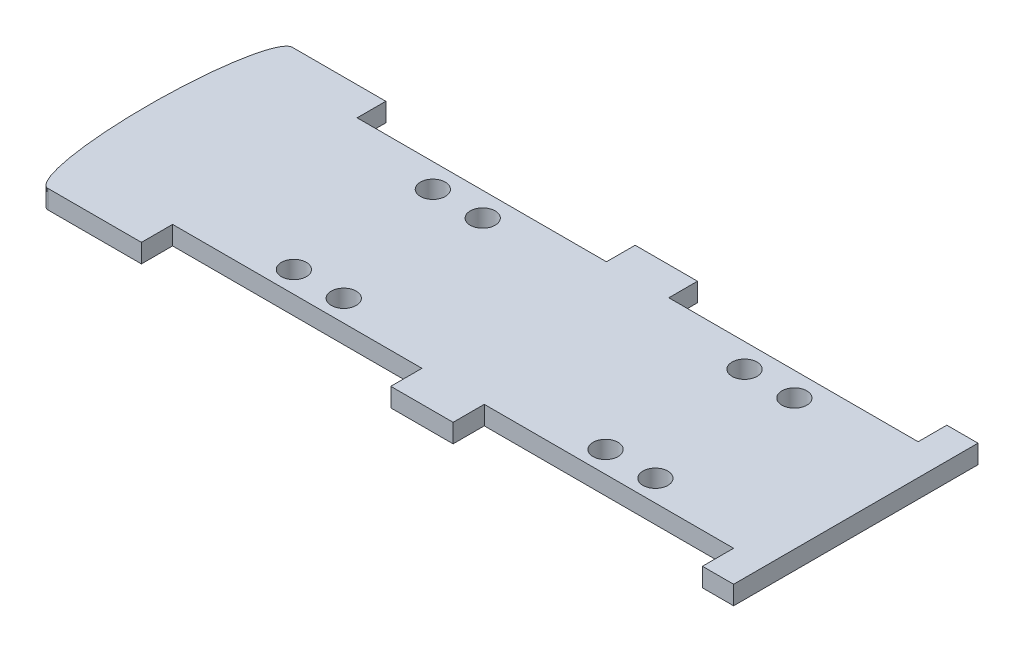
ISO-10303-21;
HEADER;
FILE_DESCRIPTION(('STEP AP214'),'2;1');
FILE_NAME('part.step','',(''),(''),'','','');
FILE_SCHEMA(('AUTOMOTIVE_DESIGN { 1 0 10303 214 1 1 1 1 }'));
ENDSEC;
DATA;
#1=APPLICATION_CONTEXT('core data for automotive mechanical design processes');
#2=APPLICATION_PROTOCOL_DEFINITION('international standard','automotive_design',2000,#1);
#3=PRODUCT_CONTEXT('',#1,'mechanical');
#4=PRODUCT('Part','Part','',(#3));
#5=PRODUCT_RELATED_PRODUCT_CATEGORY('part','',(#4));
#6=PRODUCT_DEFINITION_FORMATION('','',#4);
#7=PRODUCT_DEFINITION_CONTEXT('part definition',#1,'design');
#8=PRODUCT_DEFINITION('design','',#6,#7);
#9=PRODUCT_DEFINITION_SHAPE('','',#8);
#10=(LENGTH_UNIT() NAMED_UNIT(*) SI_UNIT(.MILLI.,.METRE.));
#11=(NAMED_UNIT(*) PLANE_ANGLE_UNIT() SI_UNIT($,.RADIAN.));
#12=(NAMED_UNIT(*) SI_UNIT($,.STERADIAN.) SOLID_ANGLE_UNIT());
#13=UNCERTAINTY_MEASURE_WITH_UNIT(LENGTH_MEASURE(1.E-05),#10,'distance_accuracy_value','');
#14=(GEOMETRIC_REPRESENTATION_CONTEXT(3) GLOBAL_UNCERTAINTY_ASSIGNED_CONTEXT((#13)) GLOBAL_UNIT_ASSIGNED_CONTEXT((#10,
#11,#12)) REPRESENTATION_CONTEXT('',''));
#15=CARTESIAN_POINT('',(0.,0.,0.));
#16=DIRECTION('',(0.,0.,1.));
#17=DIRECTION('',(1.,0.,0.));
#18=AXIS2_PLACEMENT_3D('',#15,#16,#17);
#19=CARTESIAN_POINT('',(-952.660786567319,30.,-196.023808282827));
#20=DIRECTION('',(0.,0.,-1.));
#21=DIRECTION('',(-1.,0.,0.));
#22=AXIS2_PLACEMENT_3D('',#19,#20,#21);
#23=PLANE('',#22);
#24=DIRECTION('',(1.,0.,0.));
#25=VECTOR('',#24,1.);
#26=CARTESIAN_POINT('',(-952.660786567319,0.,-196.023808282827));
#27=LINE('',#26,#25);
#28=CARTESIAN_POINT('',(-550.,0.,-196.023808282828));
#29=VERTEX_POINT('',#28);
#30=CARTESIAN_POINT('',(-400.,0.,-196.023808282828));
#31=VERTEX_POINT('',#30);
#32=EDGE_CURVE('E227',#29,#31,#27,.T.);
#33=ORIENTED_EDGE('',*,*,#32,.F.);
#34=DIRECTION('',(0.,-1.,0.));
#35=VECTOR('',#34,1.);
#36=CARTESIAN_POINT('',(-550.,30.,-196.023808282828));
#37=LINE('',#36,#35);
#38=CARTESIAN_POINT('',(-550.,30.,-196.023808282828));
#39=VERTEX_POINT('',#38);
#40=EDGE_CURVE('E11',#39,#29,#37,.T.);
#41=ORIENTED_EDGE('',*,*,#40,.F.);
#42=DIRECTION('',(1.,0.,0.));
#43=VECTOR('',#42,1.);
#44=CARTESIAN_POINT('',(-952.660786567319,30.,-196.023808282827));
#45=LINE('',#44,#43);
#46=CARTESIAN_POINT('',(-400.,30.,-196.023808282828));
#47=VERTEX_POINT('',#46);
#48=EDGE_CURVE('E296',#39,#47,#45,.T.);
#49=ORIENTED_EDGE('',*,*,#48,.T.);
#50=DIRECTION('',(0.,-1.,0.));
#51=VECTOR('',#50,1.);
#52=CARTESIAN_POINT('',(-400.,30.,-196.023808282828));
#53=LINE('',#52,#51);
#54=EDGE_CURVE('E52',#47,#31,#53,.T.);
#55=ORIENTED_EDGE('',*,*,#54,.T.);
#56=EDGE_LOOP('',(#33,#41,#49,#55));
#57=FACE_BOUND('',#56,.T.);
#58=ADVANCED_FACE('F34',(#57),#23,.T.);
#59=CARTESIAN_POINT('',(-550.,30.,0.));
#60=DIRECTION('',(0.,1.,0.));
#61=DIRECTION('',(0.,0.,1.));
#62=AXIS2_PLACEMENT_3D('',#59,#60,#61);
#63=ELLIPSE('',#62,196.023808282828,35.);
#64=DIRECTION('',(0.,-1.,0.));
#65=VECTOR('',#64,1.);
#66=SURFACE_OF_LINEAR_EXTRUSION('',#63,#65);
#67=CARTESIAN_POINT('',(-550.,0.,0.));
#68=DIRECTION('',(0.,1.,0.));
#69=DIRECTION('',(0.,0.,1.));
#70=AXIS2_PLACEMENT_3D('',#67,#68,#69);
#71=ELLIPSE('',#70,196.023808282828,35.);
#72=CARTESIAN_POINT('',(-550.,0.,196.023808282827));
#73=VERTEX_POINT('',#72);
#74=EDGE_CURVE('E229',#29,#73,#71,.T.);
#75=ORIENTED_EDGE('',*,*,#74,.T.);
#76=DIRECTION('',(0.,-1.,0.));
#77=VECTOR('',#76,1.);
#78=CARTESIAN_POINT('',(-550.,30.,196.023808282827));
#79=LINE('',#78,#77);
#80=CARTESIAN_POINT('',(-550.,30.,196.023808282827));
#81=VERTEX_POINT('',#80);
#82=EDGE_CURVE('E44',#81,#73,#79,.T.);
#83=ORIENTED_EDGE('',*,*,#82,.F.);
#84=EDGE_CURVE('E388',#39,#81,#63,.T.);
#85=ORIENTED_EDGE('',*,*,#84,.F.);
#86=ORIENTED_EDGE('',*,*,#40,.T.);
#87=EDGE_LOOP('',(#75,#83,#85,#86));
#88=FACE_BOUND('',#87,.T.);
#89=ADVANCED_FACE('F36',(#88),#66,.F.);
#90=CARTESIAN_POINT('',(-952.660786567319,30.,196.023808282827));
#91=DIRECTION('',(0.,0.,-1.));
#92=DIRECTION('',(-1.,0.,0.));
#93=AXIS2_PLACEMENT_3D('',#90,#91,#92);
#94=PLANE('',#93);
#95=DIRECTION('',(1.,0.,0.));
#96=VECTOR('',#95,1.);
#97=CARTESIAN_POINT('',(-952.660786567319,0.,196.023808282827));
#98=LINE('',#97,#96);
#99=CARTESIAN_POINT('',(-400.,0.,196.023808282827));
#100=VERTEX_POINT('',#99);
#101=EDGE_CURVE('E233',#73,#100,#98,.T.);
#102=ORIENTED_EDGE('',*,*,#101,.T.);
#103=DIRECTION('',(0.,-1.,0.));
#104=VECTOR('',#103,1.);
#105=CARTESIAN_POINT('',(-400.,30.,196.023808282827));
#106=LINE('',#105,#104);
#107=CARTESIAN_POINT('',(-400.,30.,196.023808282827));
#108=VERTEX_POINT('',#107);
#109=EDGE_CURVE('E329',#108,#100,#106,.T.);
#110=ORIENTED_EDGE('',*,*,#109,.F.);
#111=DIRECTION('',(1.,0.,0.));
#112=VECTOR('',#111,1.);
#113=CARTESIAN_POINT('',(-952.660786567319,30.,196.023808282827));
#114=LINE('',#113,#112);
#115=EDGE_CURVE('E338',#81,#108,#114,.T.);
#116=ORIENTED_EDGE('',*,*,#115,.F.);
#117=ORIENTED_EDGE('',*,*,#82,.T.);
#118=EDGE_LOOP('',(#102,#110,#116,#117));
#119=FACE_BOUND('',#118,.T.);
#120=ADVANCED_FACE('F336',(#119),#94,.F.);
#121=CARTESIAN_POINT('',(-400.,30.,-1.98809585858629));
#122=DIRECTION('',(-1.,0.,0.));
#123=DIRECTION('',(0.,0.,1.));
#124=AXIS2_PLACEMENT_3D('',#121,#122,#123);
#125=PLANE('',#124);
#126=DIRECTION('',(0.,0.,-1.));
#127=VECTOR('',#126,1.);
#128=CARTESIAN_POINT('',(-400.,0.,-1.98809585858629));
#129=LINE('',#128,#127);
#130=CARTESIAN_POINT('',(-400.,0.,146.023808282827));
#131=VERTEX_POINT('',#130);
#132=EDGE_CURVE('E235',#100,#131,#129,.T.);
#133=ORIENTED_EDGE('',*,*,#132,.T.);
#134=DIRECTION('',(0.,-1.,0.));
#135=VECTOR('',#134,1.);
#136=CARTESIAN_POINT('',(-400.,30.,146.023808282827));
#137=LINE('',#136,#135);
#138=CARTESIAN_POINT('',(-400.,30.,146.023808282827));
#139=VERTEX_POINT('',#138);
#140=EDGE_CURVE('E326',#139,#131,#137,.T.);
#141=ORIENTED_EDGE('',*,*,#140,.F.);
#142=DIRECTION('',(0.,0.,-1.));
#143=VECTOR('',#142,1.);
#144=CARTESIAN_POINT('',(-400.,30.,-1.98809585858629));
#145=LINE('',#144,#143);
#146=EDGE_CURVE('E358',#108,#139,#145,.T.);
#147=ORIENTED_EDGE('',*,*,#146,.F.);
#148=ORIENTED_EDGE('',*,*,#109,.T.);
#149=EDGE_LOOP('',(#133,#141,#147,#148));
#150=FACE_BOUND('',#149,.T.);
#151=ADVANCED_FACE('F348',(#150),#125,.F.);
#152=CARTESIAN_POINT('',(-952.660786567319,30.,146.023808282827));
#153=DIRECTION('',(0.,0.,-1.));
#154=DIRECTION('',(-1.,0.,0.));
#155=AXIS2_PLACEMENT_3D('',#152,#153,#154);
#156=PLANE('',#155);
#157=DIRECTION('',(1.,0.,0.));
#158=VECTOR('',#157,1.);
#159=CARTESIAN_POINT('',(-952.660786567319,0.,146.023808282827));
#160=LINE('',#159,#158);
#161=CARTESIAN_POINT('',(-1.11022302462516E-13,0.,146.023808282827));
#162=VERTEX_POINT('',#161);
#163=EDGE_CURVE('E237',#131,#162,#160,.T.);
#164=ORIENTED_EDGE('',*,*,#163,.T.);
#165=DIRECTION('',(0.,-1.,0.));
#166=VECTOR('',#165,1.);
#167=CARTESIAN_POINT('',(-1.11022302462516E-13,30.,146.023808282827));
#168=LINE('',#167,#166);
#169=CARTESIAN_POINT('',(-1.11022302462516E-13,30.,146.023808282827));
#170=VERTEX_POINT('',#169);
#171=EDGE_CURVE('E324',#170,#162,#168,.T.);
#172=ORIENTED_EDGE('',*,*,#171,.F.);
#173=DIRECTION('',(1.,0.,0.));
#174=VECTOR('',#173,1.);
#175=CARTESIAN_POINT('',(-952.660786567319,30.,146.023808282827));
#176=LINE('',#175,#174);
#177=EDGE_CURVE('E354',#139,#170,#176,.T.);
#178=ORIENTED_EDGE('',*,*,#177,.F.);
#179=ORIENTED_EDGE('',*,*,#140,.T.);
#180=EDGE_LOOP('',(#164,#172,#178,#179));
#181=FACE_BOUND('',#180,.T.);
#182=ADVANCED_FACE('F352',(#181),#156,.F.);
#183=CARTESIAN_POINT('',(-1.11022302462516E-13,30.,-1.98809585858629));
#184=DIRECTION('',(-1.,0.,0.));
#185=DIRECTION('',(0.,0.,1.));
#186=AXIS2_PLACEMENT_3D('',#183,#184,#185);
#187=PLANE('',#186);
#188=DIRECTION('',(0.,0.,-1.));
#189=VECTOR('',#188,1.);
#190=CARTESIAN_POINT('',(-1.11022302462516E-13,0.,-1.98809585858629));
#191=LINE('',#190,#189);
#192=CARTESIAN_POINT('',(-1.11022302462516E-13,0.,196.023808282827));
#193=VERTEX_POINT('',#192);
#194=EDGE_CURVE('E240',#193,#162,#191,.T.);
#195=ORIENTED_EDGE('',*,*,#194,.F.);
#196=DIRECTION('',(0.,-1.,0.));
#197=VECTOR('',#196,1.);
#198=CARTESIAN_POINT('',(-1.11022302462516E-13,30.,196.023808282827));
#199=LINE('',#198,#197);
#200=CARTESIAN_POINT('',(-1.11022302462516E-13,30.,196.023808282827));
#201=VERTEX_POINT('',#200);
#202=EDGE_CURVE('E322',#201,#193,#199,.T.);
#203=ORIENTED_EDGE('',*,*,#202,.F.);
#204=DIRECTION('',(0.,0.,-1.));
#205=VECTOR('',#204,1.);
#206=CARTESIAN_POINT('',(-1.11022302462516E-13,30.,-1.98809585858629));
#207=LINE('',#206,#205);
#208=EDGE_CURVE('E357',#201,#170,#207,.T.);
#209=ORIENTED_EDGE('',*,*,#208,.T.);
#210=ORIENTED_EDGE('',*,*,#171,.T.);
#211=EDGE_LOOP('',(#195,#203,#209,#210));
#212=FACE_BOUND('',#211,.T.);
#213=ADVANCED_FACE('F451',(#212),#187,.T.);
#214=CARTESIAN_POINT('',(-952.660786567319,30.,196.023808282827));
#215=DIRECTION('',(0.,0.,-1.));
#216=DIRECTION('',(-1.,0.,0.));
#217=AXIS2_PLACEMENT_3D('',#214,#215,#216);
#218=PLANE('',#217);
#219=DIRECTION('',(1.,0.,0.));
#220=VECTOR('',#219,1.);
#221=CARTESIAN_POINT('',(-952.660786567319,0.,196.023808282827));
#222=LINE('',#221,#220);
#223=CARTESIAN_POINT('',(99.9999999999999,0.,196.023808282827));
#224=VERTEX_POINT('',#223);
#225=EDGE_CURVE('E243',#193,#224,#222,.T.);
#226=ORIENTED_EDGE('',*,*,#225,.T.);
#227=DIRECTION('',(0.,-1.,0.));
#228=VECTOR('',#227,1.);
#229=CARTESIAN_POINT('',(99.9999999999999,30.,196.023808282827));
#230=LINE('',#229,#228);
#231=CARTESIAN_POINT('',(99.9999999999999,30.,196.023808282827));
#232=VERTEX_POINT('',#231);
#233=EDGE_CURVE('E319',#232,#224,#230,.T.);
#234=ORIENTED_EDGE('',*,*,#233,.F.);
#235=DIRECTION('',(1.,0.,0.));
#236=VECTOR('',#235,1.);
#237=CARTESIAN_POINT('',(-952.660786567319,30.,196.023808282827));
#238=LINE('',#237,#236);
#239=EDGE_CURVE('E360',#201,#232,#238,.T.);
#240=ORIENTED_EDGE('',*,*,#239,.F.);
#241=ORIENTED_EDGE('',*,*,#202,.T.);
#242=EDGE_LOOP('',(#226,#234,#240,#241));
#243=FACE_BOUND('',#242,.T.);
#244=ADVANCED_FACE('F449',(#243),#218,.F.);
#245=CARTESIAN_POINT('',(99.9999999999999,30.,-1.98809585858629));
#246=DIRECTION('',(-1.,0.,0.));
#247=DIRECTION('',(0.,0.,1.));
#248=AXIS2_PLACEMENT_3D('',#245,#246,#247);
#249=PLANE('',#248);
#250=DIRECTION('',(0.,0.,-1.));
#251=VECTOR('',#250,1.);
#252=CARTESIAN_POINT('',(99.9999999999999,0.,-1.98809585858629));
#253=LINE('',#252,#251);
#254=CARTESIAN_POINT('',(99.9999999999999,0.,146.023808282827));
#255=VERTEX_POINT('',#254);
#256=EDGE_CURVE('E245',#224,#255,#253,.T.);
#257=ORIENTED_EDGE('',*,*,#256,.T.);
#258=DIRECTION('',(0.,-1.,0.));
#259=VECTOR('',#258,1.);
#260=CARTESIAN_POINT('',(99.9999999999999,30.,146.023808282827));
#261=LINE('',#260,#259);
#262=CARTESIAN_POINT('',(99.9999999999999,30.,146.023808282827));
#263=VERTEX_POINT('',#262);
#264=EDGE_CURVE('E317',#263,#255,#261,.T.);
#265=ORIENTED_EDGE('',*,*,#264,.F.);
#266=DIRECTION('',(0.,0.,-1.));
#267=VECTOR('',#266,1.);
#268=CARTESIAN_POINT('',(99.9999999999999,30.,-1.98809585858629));
#269=LINE('',#268,#267);
#270=EDGE_CURVE('E366',#232,#263,#269,.T.);
#271=ORIENTED_EDGE('',*,*,#270,.F.);
#272=ORIENTED_EDGE('',*,*,#233,.T.);
#273=EDGE_LOOP('',(#257,#265,#271,#272));
#274=FACE_BOUND('',#273,.T.);
#275=ADVANCED_FACE('F444',(#274),#249,.F.);
#276=CARTESIAN_POINT('',(-952.660786567319,30.,146.023808282828));
#277=DIRECTION('',(0.,0.,1.));
#278=DIRECTION('',(1.,0.,0.));
#279=AXIS2_PLACEMENT_3D('',#276,#277,#278);
#280=PLANE('',#279);
#281=DIRECTION('',(-1.,0.,0.));
#282=VECTOR('',#281,1.);
#283=CARTESIAN_POINT('',(-952.660786567319,0.,146.023808282828));
#284=LINE('',#283,#282);
#285=CARTESIAN_POINT('',(500.,0.,146.023808282827));
#286=VERTEX_POINT('',#285);
#287=EDGE_CURVE('E249',#286,#255,#284,.T.);
#288=ORIENTED_EDGE('',*,*,#287,.F.);
#289=DIRECTION('',(0.,-1.,0.));
#290=VECTOR('',#289,1.);
#291=CARTESIAN_POINT('',(500.,30.,146.023808282827));
#292=LINE('',#291,#290);
#293=CARTESIAN_POINT('',(500.,30.,146.023808282827));
#294=VERTEX_POINT('',#293);
#295=EDGE_CURVE('E315',#294,#286,#292,.T.);
#296=ORIENTED_EDGE('',*,*,#295,.F.);
#297=DIRECTION('',(-1.,0.,0.));
#298=VECTOR('',#297,1.);
#299=CARTESIAN_POINT('',(-952.660786567319,30.,146.023808282828));
#300=LINE('',#299,#298);
#301=EDGE_CURVE('E369',#294,#263,#300,.T.);
#302=ORIENTED_EDGE('',*,*,#301,.T.);
#303=ORIENTED_EDGE('',*,*,#264,.T.);
#304=EDGE_LOOP('',(#288,#296,#302,#303));
#305=FACE_BOUND('',#304,.T.);
#306=ADVANCED_FACE('F438',(#305),#280,.T.);
#307=CARTESIAN_POINT('',(500.,30.,-1.98809585858629));
#308=DIRECTION('',(-1.,0.,0.));
#309=DIRECTION('',(0.,0.,1.));
#310=AXIS2_PLACEMENT_3D('',#307,#308,#309);
#311=PLANE('',#310);
#312=DIRECTION('',(0.,0.,-1.));
#313=VECTOR('',#312,1.);
#314=CARTESIAN_POINT('',(500.,0.,-1.98809585858629));
#315=LINE('',#314,#313);
#316=CARTESIAN_POINT('',(500.,0.,196.023808282827));
#317=VERTEX_POINT('',#316);
#318=EDGE_CURVE('E252',#317,#286,#315,.T.);
#319=ORIENTED_EDGE('',*,*,#318,.F.);
#320=DIRECTION('',(0.,-1.,0.));
#321=VECTOR('',#320,1.);
#322=CARTESIAN_POINT('',(500.,30.,196.023808282827));
#323=LINE('',#322,#321);
#324=CARTESIAN_POINT('',(500.,30.,196.023808282827));
#325=VERTEX_POINT('',#324);
#326=EDGE_CURVE('E313',#325,#317,#323,.T.);
#327=ORIENTED_EDGE('',*,*,#326,.F.);
#328=DIRECTION('',(0.,0.,-1.));
#329=VECTOR('',#328,1.);
#330=CARTESIAN_POINT('',(500.,30.,-1.98809585858629));
#331=LINE('',#330,#329);
#332=EDGE_CURVE('E372',#325,#294,#331,.T.);
#333=ORIENTED_EDGE('',*,*,#332,.T.);
#334=ORIENTED_EDGE('',*,*,#295,.T.);
#335=EDGE_LOOP('',(#319,#327,#333,#334));
#336=FACE_BOUND('',#335,.T.);
#337=ADVANCED_FACE('F433',(#336),#311,.T.);
#338=CARTESIAN_POINT('',(550.,0.,196.023808282827));
#339=VERTEX_POINT('',#338);
#340=EDGE_CURVE('E246',#317,#339,#222,.T.);
#341=ORIENTED_EDGE('',*,*,#340,.T.);
#342=DIRECTION('',(0.,-1.,0.));
#343=VECTOR('',#342,1.);
#344=CARTESIAN_POINT('',(550.,30.,196.023808282827));
#345=LINE('',#344,#343);
#346=CARTESIAN_POINT('',(550.,30.,196.023808282827));
#347=VERTEX_POINT('',#346);
#348=EDGE_CURVE('E311',#347,#339,#345,.T.);
#349=ORIENTED_EDGE('',*,*,#348,.F.);
#350=EDGE_CURVE('E367',#325,#347,#238,.T.);
#351=ORIENTED_EDGE('',*,*,#350,.F.);
#352=ORIENTED_EDGE('',*,*,#326,.T.);
#353=EDGE_LOOP('',(#341,#349,#351,#352));
#354=FACE_BOUND('',#353,.T.);
#355=ADVANCED_FACE('F430',(#354),#218,.F.);
#356=CARTESIAN_POINT('',(550.,30.,-1.98809585858671));
#357=DIRECTION('',(1.,0.,0.));
#358=DIRECTION('',(0.,0.,-1.));
#359=AXIS2_PLACEMENT_3D('',#356,#357,#358);
#360=PLANE('',#359);
#361=DIRECTION('',(0.,0.,1.));
#362=VECTOR('',#361,1.);
#363=CARTESIAN_POINT('',(550.,0.,-1.98809585858671));
#364=LINE('',#363,#362);
#365=CARTESIAN_POINT('',(550.,0.,-196.023808282828));
#366=VERTEX_POINT('',#365);
#367=EDGE_CURVE('E255',#366,#339,#364,.T.);
#368=ORIENTED_EDGE('',*,*,#367,.F.);
#369=DIRECTION('',(0.,-1.,0.));
#370=VECTOR('',#369,1.);
#371=CARTESIAN_POINT('',(550.,30.,-196.023808282828));
#372=LINE('',#371,#370);
#373=CARTESIAN_POINT('',(550.,30.,-196.023808282828));
#374=VERTEX_POINT('',#373);
#375=EDGE_CURVE('E309',#374,#366,#372,.T.);
#376=ORIENTED_EDGE('',*,*,#375,.F.);
#377=DIRECTION('',(0.,0.,1.));
#378=VECTOR('',#377,1.);
#379=CARTESIAN_POINT('',(550.,30.,-1.98809585858671));
#380=LINE('',#379,#378);
#381=EDGE_CURVE('E375',#374,#347,#380,.T.);
#382=ORIENTED_EDGE('',*,*,#381,.T.);
#383=ORIENTED_EDGE('',*,*,#348,.T.);
#384=EDGE_LOOP('',(#368,#376,#382,#383));
#385=FACE_BOUND('',#384,.T.);
#386=ADVANCED_FACE('F404',(#385),#360,.T.);
#387=CARTESIAN_POINT('',(500.,0.,-196.023808282828));
#388=VERTEX_POINT('',#387);
#389=EDGE_CURVE('E231',#388,#366,#27,.T.);
#390=ORIENTED_EDGE('',*,*,#389,.F.);
#391=DIRECTION('',(0.,-1.,0.));
#392=VECTOR('',#391,1.);
#393=CARTESIAN_POINT('',(500.,30.,-196.023808282828));
#394=LINE('',#393,#392);
#395=CARTESIAN_POINT('',(500.,30.,-196.023808282828));
#396=VERTEX_POINT('',#395);
#397=EDGE_CURVE('E307',#396,#388,#394,.T.);
#398=ORIENTED_EDGE('',*,*,#397,.F.);
#399=EDGE_CURVE('E378',#396,#374,#45,.T.);
#400=ORIENTED_EDGE('',*,*,#399,.T.);
#401=ORIENTED_EDGE('',*,*,#375,.T.);
#402=EDGE_LOOP('',(#390,#398,#400,#401));
#403=FACE_BOUND('',#402,.T.);
#404=ADVANCED_FACE('F396',(#403),#23,.T.);
#405=CARTESIAN_POINT('',(500.,30.,-1.98809585858629));
#406=DIRECTION('',(1.,0.,0.));
#407=DIRECTION('',(0.,0.,-1.));
#408=AXIS2_PLACEMENT_3D('',#405,#406,#407);
#409=PLANE('',#408);
#410=DIRECTION('',(0.,0.,1.));
#411=VECTOR('',#410,1.);
#412=CARTESIAN_POINT('',(500.,0.,-1.98809585858629));
#413=LINE('',#412,#411);
#414=CARTESIAN_POINT('',(500.,0.,-150.));
#415=VERTEX_POINT('',#414);
#416=EDGE_CURVE('E258',#388,#415,#413,.T.);
#417=ORIENTED_EDGE('',*,*,#416,.T.);
#418=DIRECTION('',(0.,-1.,0.));
#419=VECTOR('',#418,1.);
#420=CARTESIAN_POINT('',(500.,30.,-150.));
#421=LINE('',#420,#419);
#422=CARTESIAN_POINT('',(500.,30.,-150.));
#423=VERTEX_POINT('',#422);
#424=EDGE_CURVE('E304',#423,#415,#421,.T.);
#425=ORIENTED_EDGE('',*,*,#424,.F.);
#426=DIRECTION('',(0.,0.,1.));
#427=VECTOR('',#426,1.);
#428=CARTESIAN_POINT('',(500.,30.,-1.98809585858629));
#429=LINE('',#428,#427);
#430=EDGE_CURVE('E379',#396,#423,#429,.T.);
#431=ORIENTED_EDGE('',*,*,#430,.F.);
#432=ORIENTED_EDGE('',*,*,#397,.T.);
#433=EDGE_LOOP('',(#417,#425,#431,#432));
#434=FACE_BOUND('',#433,.T.);
#435=ADVANCED_FACE('F403',(#434),#409,.F.);
#436=CARTESIAN_POINT('',(-952.660786567319,30.,-150.));
#437=DIRECTION('',(0.,0.,1.));
#438=DIRECTION('',(1.,0.,0.));
#439=AXIS2_PLACEMENT_3D('',#436,#437,#438);
#440=PLANE('',#439);
#441=DIRECTION('',(-1.,0.,0.));
#442=VECTOR('',#441,1.);
#443=CARTESIAN_POINT('',(-952.660786567319,0.,-150.));
#444=LINE('',#443,#442);
#445=CARTESIAN_POINT('',(99.9999999999999,0.,-150.));
#446=VERTEX_POINT('',#445);
#447=EDGE_CURVE('E260',#415,#446,#444,.T.);
#448=ORIENTED_EDGE('',*,*,#447,.T.);
#449=DIRECTION('',(0.,-1.,0.));
#450=VECTOR('',#449,1.);
#451=CARTESIAN_POINT('',(99.9999999999999,30.,-150.));
#452=LINE('',#451,#450);
#453=CARTESIAN_POINT('',(99.9999999999999,30.,-150.));
#454=VERTEX_POINT('',#453);
#455=EDGE_CURVE('E302',#454,#446,#452,.T.);
#456=ORIENTED_EDGE('',*,*,#455,.F.);
#457=DIRECTION('',(-1.,0.,0.));
#458=VECTOR('',#457,1.);
#459=CARTESIAN_POINT('',(-952.660786567319,30.,-150.));
#460=LINE('',#459,#458);
#461=EDGE_CURVE('E381',#423,#454,#460,.T.);
#462=ORIENTED_EDGE('',*,*,#461,.F.);
#463=ORIENTED_EDGE('',*,*,#424,.T.);
#464=EDGE_LOOP('',(#448,#456,#462,#463));
#465=FACE_BOUND('',#464,.T.);
#466=ADVANCED_FACE('F412',(#465),#440,.F.);
#467=CARTESIAN_POINT('',(99.9999999999999,30.,-1.98809585858629));
#468=DIRECTION('',(1.,0.,0.));
#469=DIRECTION('',(0.,0.,-1.));
#470=AXIS2_PLACEMENT_3D('',#467,#468,#469);
#471=PLANE('',#470);
#472=DIRECTION('',(0.,0.,1.));
#473=VECTOR('',#472,1.);
#474=CARTESIAN_POINT('',(99.9999999999999,0.,-1.98809585858629));
#475=LINE('',#474,#473);
#476=CARTESIAN_POINT('',(99.9999999999998,0.,-196.023808282828));
#477=VERTEX_POINT('',#476);
#478=EDGE_CURVE('E263',#477,#446,#475,.T.);
#479=ORIENTED_EDGE('',*,*,#478,.F.);
#480=DIRECTION('',(0.,-1.,0.));
#481=VECTOR('',#480,1.);
#482=CARTESIAN_POINT('',(99.9999999999998,30.,-196.023808282828));
#483=LINE('',#482,#481);
#484=CARTESIAN_POINT('',(99.9999999999998,30.,-196.023808282828));
#485=VERTEX_POINT('',#484);
#486=EDGE_CURVE('E300',#485,#477,#483,.T.);
#487=ORIENTED_EDGE('',*,*,#486,.F.);
#488=DIRECTION('',(0.,0.,1.));
#489=VECTOR('',#488,1.);
#490=CARTESIAN_POINT('',(99.9999999999999,30.,-1.98809585858629));
#491=LINE('',#490,#489);
#492=EDGE_CURVE('E382',#485,#454,#491,.T.);
#493=ORIENTED_EDGE('',*,*,#492,.T.);
#494=ORIENTED_EDGE('',*,*,#455,.T.);
#495=EDGE_LOOP('',(#479,#487,#493,#494));
#496=FACE_BOUND('',#495,.T.);
#497=ADVANCED_FACE('F407',(#496),#471,.T.);
#498=CARTESIAN_POINT('',(-1.11022302462516E-13,0.,-196.023808282828));
#499=VERTEX_POINT('',#498);
#500=EDGE_CURVE('E230',#499,#477,#27,.T.);
#501=ORIENTED_EDGE('',*,*,#500,.F.);
#502=DIRECTION('',(0.,-1.,0.));
#503=VECTOR('',#502,1.);
#504=CARTESIAN_POINT('',(-1.11022302462516E-13,30.,-196.023808282828));
#505=LINE('',#504,#503);
#506=CARTESIAN_POINT('',(-1.11022302462516E-13,30.,-196.023808282828));
#507=VERTEX_POINT('',#506);
#508=EDGE_CURVE('E195',#507,#499,#505,.T.);
#509=ORIENTED_EDGE('',*,*,#508,.F.);
#510=EDGE_CURVE('E185',#507,#485,#45,.T.);
#511=ORIENTED_EDGE('',*,*,#510,.T.);
#512=ORIENTED_EDGE('',*,*,#486,.T.);
#513=EDGE_LOOP('',(#501,#509,#511,#512));
#514=FACE_BOUND('',#513,.T.);
#515=ADVANCED_FACE('F397',(#514),#23,.T.);
#516=CARTESIAN_POINT('',(-1.11022302462516E-13,30.,-1.98809585858629));
#517=DIRECTION('',(1.,0.,0.));
#518=DIRECTION('',(0.,0.,-1.));
#519=AXIS2_PLACEMENT_3D('',#516,#517,#518);
#520=PLANE('',#519);
#521=DIRECTION('',(0.,0.,1.));
#522=VECTOR('',#521,1.);
#523=CARTESIAN_POINT('',(-1.11022302462516E-13,0.,-1.98809585858629));
#524=LINE('',#523,#522);
#525=CARTESIAN_POINT('',(-1.11022302462516E-13,0.,-150.));
#526=VERTEX_POINT('',#525);
#527=EDGE_CURVE('E192',#499,#526,#524,.T.);
#528=ORIENTED_EDGE('',*,*,#527,.T.);
#529=DIRECTION('',(0.,-1.,0.));
#530=VECTOR('',#529,1.);
#531=CARTESIAN_POINT('',(-1.11022302462516E-13,30.,-150.));
#532=LINE('',#531,#530);
#533=CARTESIAN_POINT('',(-1.11022302462516E-13,30.,-150.));
#534=VERTEX_POINT('',#533);
#535=EDGE_CURVE('E189',#534,#526,#532,.T.);
#536=ORIENTED_EDGE('',*,*,#535,.F.);
#537=DIRECTION('',(0.,0.,1.));
#538=VECTOR('',#537,1.);
#539=CARTESIAN_POINT('',(-1.11022302462516E-13,30.,-1.98809585858629));
#540=LINE('',#539,#538);
#541=EDGE_CURVE('E175',#507,#534,#540,.T.);
#542=ORIENTED_EDGE('',*,*,#541,.F.);
#543=ORIENTED_EDGE('',*,*,#508,.T.);
#544=EDGE_LOOP('',(#528,#536,#542,#543));
#545=FACE_BOUND('',#544,.T.);
#546=ADVANCED_FACE('F190',(#545),#520,.F.);
#547=CARTESIAN_POINT('',(-952.660786567319,30.,-150.));
#548=DIRECTION('',(0.,0.,-1.));
#549=DIRECTION('',(-1.,0.,0.));
#550=AXIS2_PLACEMENT_3D('',#547,#548,#549);
#551=PLANE('',#550);
#552=DIRECTION('',(1.,0.,0.));
#553=VECTOR('',#552,1.);
#554=CARTESIAN_POINT('',(-952.660786567319,0.,-150.));
#555=LINE('',#554,#553);
#556=CARTESIAN_POINT('',(-400.,0.,-150.));
#557=VERTEX_POINT('',#556);
#558=EDGE_CURVE('E267',#557,#526,#555,.T.);
#559=ORIENTED_EDGE('',*,*,#558,.F.);
#560=DIRECTION('',(0.,-1.,0.));
#561=VECTOR('',#560,1.);
#562=CARTESIAN_POINT('',(-400.,30.,-150.));
#563=LINE('',#562,#561);
#564=CARTESIAN_POINT('',(-400.,30.,-150.));
#565=VERTEX_POINT('',#564);
#566=EDGE_CURVE('E113',#565,#557,#563,.T.);
#567=ORIENTED_EDGE('',*,*,#566,.F.);
#568=DIRECTION('',(1.,0.,0.));
#569=VECTOR('',#568,1.);
#570=CARTESIAN_POINT('',(-952.660786567319,30.,-150.));
#571=LINE('',#570,#569);
#572=EDGE_CURVE('E182',#565,#534,#571,.T.);
#573=ORIENTED_EDGE('',*,*,#572,.T.);
#574=ORIENTED_EDGE('',*,*,#535,.T.);
#575=EDGE_LOOP('',(#559,#567,#573,#574));
#576=FACE_BOUND('',#575,.T.);
#577=ADVANCED_FACE('F197',(#576),#551,.T.);
#578=CARTESIAN_POINT('',(260.,30.,-111.462676561956));
#579=DIRECTION('',(0.,-1.,0.));
#580=DIRECTION('',(0.,0.,-1.));
#581=AXIS2_PLACEMENT_3D('',#578,#579,#580);
#582=CYLINDRICAL_SURFACE('',#581,19.9999999999999);
#583=CARTESIAN_POINT('',(260.,30.,-111.462676561956));
#584=DIRECTION('',(0.,1.,0.));
#585=DIRECTION('',(0.,0.,1.));
#586=AXIS2_PLACEMENT_3D('',#583,#584,#585);
#587=CIRCLE('',#586,19.9999999999999);
#588=CARTESIAN_POINT('',(260.,30.,-91.4626765619562));
#589=VERTEX_POINT('',#588);
#590=EDGE_CURVE('E221',#589,#589,#587,.T.);
#591=ORIENTED_EDGE('',*,*,#590,.T.);
#592=EDGE_LOOP('',(#591));
#593=FACE_BOUND('',#592,.T.);
#594=CARTESIAN_POINT('',(260.,0.,-111.462676561956));
#595=DIRECTION('',(0.,1.,0.));
#596=DIRECTION('',(0.,0.,1.));
#597=AXIS2_PLACEMENT_3D('',#594,#595,#596);
#598=CIRCLE('',#597,19.9999999999999);
#599=CARTESIAN_POINT('',(260.,0.,-91.4626765619562));
#600=VERTEX_POINT('',#599);
#601=EDGE_CURVE('E290',#600,#600,#598,.T.);
#602=ORIENTED_EDGE('',*,*,#601,.F.);
#603=EDGE_LOOP('',(#602));
#604=FACE_BOUND('',#603,.T.);
#605=ADVANCED_FACE('F553',(#593,#604),#582,.F.);
#606=CARTESIAN_POINT('',(260.,30.,111.462676561956));
#607=DIRECTION('',(0.,-1.,0.));
#608=DIRECTION('',(0.,0.,-1.));
#609=AXIS2_PLACEMENT_3D('',#606,#607,#608);
#610=CYLINDRICAL_SURFACE('',#609,19.9999999999999);
#611=CARTESIAN_POINT('',(260.,30.,111.462676561956));
#612=DIRECTION('',(0.,1.,0.));
#613=DIRECTION('',(0.,0.,1.));
#614=AXIS2_PLACEMENT_3D('',#611,#612,#613);
#615=CIRCLE('',#614,19.9999999999999);
#616=CARTESIAN_POINT('',(260.,30.,131.462676561956));
#617=VERTEX_POINT('',#616);
#618=EDGE_CURVE('E218',#617,#617,#615,.F.);
#619=ORIENTED_EDGE('',*,*,#618,.F.);
#620=EDGE_LOOP('',(#619));
#621=FACE_BOUND('',#620,.T.);
#622=CARTESIAN_POINT('',(260.,0.,111.462676561956));
#623=DIRECTION('',(0.,1.,0.));
#624=DIRECTION('',(0.,0.,1.));
#625=AXIS2_PLACEMENT_3D('',#622,#623,#624);
#626=CIRCLE('',#625,19.9999999999999);
#627=CARTESIAN_POINT('',(260.,0.,131.462676561956));
#628=VERTEX_POINT('',#627);
#629=EDGE_CURVE('E287',#628,#628,#626,.F.);
#630=ORIENTED_EDGE('',*,*,#629,.T.);
#631=EDGE_LOOP('',(#630));
#632=FACE_BOUND('',#631,.T.);
#633=ADVANCED_FACE('F562',(#621,#632),#610,.F.);
#634=CARTESIAN_POINT('',(-160.,30.,111.462676561956));
#635=DIRECTION('',(0.,-1.,0.));
#636=DIRECTION('',(0.,0.,-1.));
#637=AXIS2_PLACEMENT_3D('',#634,#635,#636);
#638=CYLINDRICAL_SURFACE('',#637,20.);
#639=CARTESIAN_POINT('',(-160.,30.,111.462676561956));
#640=DIRECTION('',(0.,1.,0.));
#641=DIRECTION('',(0.,0.,1.));
#642=AXIS2_PLACEMENT_3D('',#639,#640,#641);
#643=CIRCLE('',#642,20.);
#644=CARTESIAN_POINT('',(-160.,30.,131.462676561956));
#645=VERTEX_POINT('',#644);
#646=EDGE_CURVE('E215',#645,#645,#643,.T.);
#647=ORIENTED_EDGE('',*,*,#646,.T.);
#648=EDGE_LOOP('',(#647));
#649=FACE_BOUND('',#648,.T.);
#650=CARTESIAN_POINT('',(-160.,0.,111.462676561956));
#651=DIRECTION('',(0.,1.,0.));
#652=DIRECTION('',(0.,0.,1.));
#653=AXIS2_PLACEMENT_3D('',#650,#651,#652);
#654=CIRCLE('',#653,20.);
#655=CARTESIAN_POINT('',(-160.,0.,131.462676561956));
#656=VERTEX_POINT('',#655);
#657=EDGE_CURVE('E284',#656,#656,#654,.T.);
#658=ORIENTED_EDGE('',*,*,#657,.F.);
#659=EDGE_LOOP('',(#658));
#660=FACE_BOUND('',#659,.T.);
#661=ADVANCED_FACE('F572',(#649,#660),#638,.F.);
#662=CARTESIAN_POINT('',(-240.,30.,111.462676561956));
#663=DIRECTION('',(0.,-1.,0.));
#664=DIRECTION('',(0.,0.,-1.));
#665=AXIS2_PLACEMENT_3D('',#662,#663,#664);
#666=CYLINDRICAL_SURFACE('',#665,20.);
#667=CARTESIAN_POINT('',(-240.,30.,111.462676561956));
#668=DIRECTION('',(0.,1.,0.));
#669=DIRECTION('',(0.,0.,1.));
#670=AXIS2_PLACEMENT_3D('',#667,#668,#669);
#671=CIRCLE('',#670,20.);
#672=CARTESIAN_POINT('',(-240.,30.,131.462676561956));
#673=VERTEX_POINT('',#672);
#674=EDGE_CURVE('E212',#673,#673,#671,.F.);
#675=ORIENTED_EDGE('',*,*,#674,.F.);
#676=EDGE_LOOP('',(#675));
#677=FACE_BOUND('',#676,.T.);
#678=CARTESIAN_POINT('',(-240.,0.,111.462676561956));
#679=DIRECTION('',(0.,1.,0.));
#680=DIRECTION('',(0.,0.,1.));
#681=AXIS2_PLACEMENT_3D('',#678,#679,#680);
#682=CIRCLE('',#681,20.);
#683=CARTESIAN_POINT('',(-240.,0.,131.462676561956));
#684=VERTEX_POINT('',#683);
#685=EDGE_CURVE('E281',#684,#684,#682,.F.);
#686=ORIENTED_EDGE('',*,*,#685,.T.);
#687=EDGE_LOOP('',(#686));
#688=FACE_BOUND('',#687,.T.);
#689=ADVANCED_FACE('F582',(#677,#688),#666,.F.);
#690=CARTESIAN_POINT('',(340.,30.,111.462676561956));
#691=DIRECTION('',(0.,-1.,0.));
#692=DIRECTION('',(0.,0.,-1.));
#693=AXIS2_PLACEMENT_3D('',#690,#691,#692);
#694=CYLINDRICAL_SURFACE('',#693,20.);
#695=CARTESIAN_POINT('',(340.,30.,111.462676561956));
#696=DIRECTION('',(0.,1.,0.));
#697=DIRECTION('',(0.,0.,1.));
#698=AXIS2_PLACEMENT_3D('',#695,#696,#697);
#699=CIRCLE('',#698,20.);
#700=CARTESIAN_POINT('',(340.,30.,131.462676561956));
#701=VERTEX_POINT('',#700);
#702=EDGE_CURVE('E209',#701,#701,#699,.T.);
#703=ORIENTED_EDGE('',*,*,#702,.T.);
#704=EDGE_LOOP('',(#703));
#705=FACE_BOUND('',#704,.T.);
#706=CARTESIAN_POINT('',(340.,0.,111.462676561956));
#707=DIRECTION('',(0.,1.,0.));
#708=DIRECTION('',(0.,0.,1.));
#709=AXIS2_PLACEMENT_3D('',#706,#707,#708);
#710=CIRCLE('',#709,20.);
#711=CARTESIAN_POINT('',(340.,0.,131.462676561956));
#712=VERTEX_POINT('',#711);
#713=EDGE_CURVE('E278',#712,#712,#710,.T.);
#714=ORIENTED_EDGE('',*,*,#713,.F.);
#715=EDGE_LOOP('',(#714));
#716=FACE_BOUND('',#715,.T.);
#717=ADVANCED_FACE('F592',(#705,#716),#694,.F.);
#718=CARTESIAN_POINT('',(340.,30.,-111.462676561956));
#719=DIRECTION('',(0.,-1.,0.));
#720=DIRECTION('',(0.,0.,-1.));
#721=AXIS2_PLACEMENT_3D('',#718,#719,#720);
#722=CYLINDRICAL_SURFACE('',#721,20.);
#723=CARTESIAN_POINT('',(340.,30.,-111.462676561956));
#724=DIRECTION('',(0.,1.,0.));
#725=DIRECTION('',(0.,0.,1.));
#726=AXIS2_PLACEMENT_3D('',#723,#724,#725);
#727=CIRCLE('',#726,20.);
#728=CARTESIAN_POINT('',(340.,30.,-91.4626765619561));
#729=VERTEX_POINT('',#728);
#730=EDGE_CURVE('E206',#729,#729,#727,.F.);
#731=ORIENTED_EDGE('',*,*,#730,.F.);
#732=EDGE_LOOP('',(#731));
#733=FACE_BOUND('',#732,.T.);
#734=CARTESIAN_POINT('',(340.,0.,-111.462676561956));
#735=DIRECTION('',(0.,1.,0.));
#736=DIRECTION('',(0.,0.,1.));
#737=AXIS2_PLACEMENT_3D('',#734,#735,#736);
#738=CIRCLE('',#737,20.);
#739=CARTESIAN_POINT('',(340.,0.,-91.4626765619561));
#740=VERTEX_POINT('',#739);
#741=EDGE_CURVE('E275',#740,#740,#738,.F.);
#742=ORIENTED_EDGE('',*,*,#741,.T.);
#743=EDGE_LOOP('',(#742));
#744=FACE_BOUND('',#743,.T.);
#745=ADVANCED_FACE('F602',(#733,#744),#722,.F.);
#746=CARTESIAN_POINT('',(-240.,30.,-111.462676561956));
#747=DIRECTION('',(0.,-1.,0.));
#748=DIRECTION('',(0.,0.,-1.));
#749=AXIS2_PLACEMENT_3D('',#746,#747,#748);
#750=CYLINDRICAL_SURFACE('',#749,20.);
#751=CARTESIAN_POINT('',(-240.,30.,-111.462676561956));
#752=DIRECTION('',(0.,1.,0.));
#753=DIRECTION('',(0.,0.,1.));
#754=AXIS2_PLACEMENT_3D('',#751,#752,#753);
#755=CIRCLE('',#754,20.);
#756=CARTESIAN_POINT('',(-240.,30.,-91.4626765619563));
#757=VERTEX_POINT('',#756);
#758=EDGE_CURVE('E200',#757,#757,#755,.T.);
#759=ORIENTED_EDGE('',*,*,#758,.T.);
#760=EDGE_LOOP('',(#759));
#761=FACE_BOUND('',#760,.T.);
#762=CARTESIAN_POINT('',(-240.,0.,-111.462676561956));
#763=DIRECTION('',(0.,1.,0.));
#764=DIRECTION('',(0.,0.,1.));
#765=AXIS2_PLACEMENT_3D('',#762,#763,#764);
#766=CIRCLE('',#765,20.);
#767=CARTESIAN_POINT('',(-240.,0.,-91.4626765619563));
#768=VERTEX_POINT('',#767);
#769=EDGE_CURVE('E272',#768,#768,#766,.T.);
#770=ORIENTED_EDGE('',*,*,#769,.F.);
#771=EDGE_LOOP('',(#770));
#772=FACE_BOUND('',#771,.T.);
#773=ADVANCED_FACE('F612',(#761,#772),#750,.F.);
#774=CARTESIAN_POINT('',(-400.,30.,-1.98809585858629));
#775=DIRECTION('',(1.,0.,0.));
#776=DIRECTION('',(0.,0.,-1.));
#777=AXIS2_PLACEMENT_3D('',#774,#775,#776);
#778=PLANE('',#777);
#779=DIRECTION('',(0.,0.,1.));
#780=VECTOR('',#779,1.);
#781=CARTESIAN_POINT('',(-400.,0.,-1.98809585858629));
#782=LINE('',#781,#780);
#783=EDGE_CURVE('E269',#31,#557,#782,.T.);
#784=ORIENTED_EDGE('',*,*,#783,.F.);
#785=ORIENTED_EDGE('',*,*,#54,.F.);
#786=DIRECTION('',(0.,0.,1.));
#787=VECTOR('',#786,1.);
#788=CARTESIAN_POINT('',(-400.,30.,-1.98809585858629));
#789=LINE('',#788,#787);
#790=EDGE_CURVE('E198',#47,#565,#789,.T.);
#791=ORIENTED_EDGE('',*,*,#790,.T.);
#792=ORIENTED_EDGE('',*,*,#566,.T.);
#793=EDGE_LOOP('',(#784,#785,#791,#792));
#794=FACE_BOUND('',#793,.T.);
#795=ADVANCED_FACE('F622',(#794),#778,.T.);
#796=CARTESIAN_POINT('',(-160.,30.,-111.462676561956));
#797=DIRECTION('',(0.,-1.,0.));
#798=DIRECTION('',(0.,0.,-1.));
#799=AXIS2_PLACEMENT_3D('',#796,#797,#798);
#800=CYLINDRICAL_SURFACE('',#799,20.);
#801=CARTESIAN_POINT('',(-160.,30.,-111.462676561956));
#802=DIRECTION('',(0.,1.,0.));
#803=DIRECTION('',(0.,0.,1.));
#804=AXIS2_PLACEMENT_3D('',#801,#802,#803);
#805=CIRCLE('',#804,20.);
#806=CARTESIAN_POINT('',(-160.,30.,-91.4626765619564));
#807=VERTEX_POINT('',#806);
#808=EDGE_CURVE('E224',#807,#807,#805,.F.);
#809=ORIENTED_EDGE('',*,*,#808,.F.);
#810=EDGE_LOOP('',(#809));
#811=FACE_BOUND('',#810,.T.);
#812=CARTESIAN_POINT('',(-160.,0.,-111.462676561956));
#813=DIRECTION('',(0.,1.,0.));
#814=DIRECTION('',(0.,0.,1.));
#815=AXIS2_PLACEMENT_3D('',#812,#813,#814);
#816=CIRCLE('',#815,20.);
#817=CARTESIAN_POINT('',(-160.,0.,-91.4626765619564));
#818=VERTEX_POINT('',#817);
#819=EDGE_CURVE('E293',#818,#818,#816,.F.);
#820=ORIENTED_EDGE('',*,*,#819,.T.);
#821=EDGE_LOOP('',(#820));
#822=FACE_BOUND('',#821,.T.);
#823=ADVANCED_FACE('F632',(#811,#822),#800,.F.);
#824=CARTESIAN_POINT('',(-952.660786567319,30.,-1.98809585858629));
#825=DIRECTION('',(0.,1.,0.));
#826=DIRECTION('',(0.,0.,1.));
#827=AXIS2_PLACEMENT_3D('',#824,#825,#826);
#828=PLANE('',#827);
#829=ORIENTED_EDGE('',*,*,#48,.F.);
#830=ORIENTED_EDGE('',*,*,#84,.T.);
#831=ORIENTED_EDGE('',*,*,#115,.T.);
#832=ORIENTED_EDGE('',*,*,#146,.T.);
#833=ORIENTED_EDGE('',*,*,#177,.T.);
#834=ORIENTED_EDGE('',*,*,#208,.F.);
#835=ORIENTED_EDGE('',*,*,#239,.T.);
#836=ORIENTED_EDGE('',*,*,#270,.T.);
#837=ORIENTED_EDGE('',*,*,#301,.F.);
#838=ORIENTED_EDGE('',*,*,#332,.F.);
#839=ORIENTED_EDGE('',*,*,#350,.T.);
#840=ORIENTED_EDGE('',*,*,#381,.F.);
#841=ORIENTED_EDGE('',*,*,#399,.F.);
#842=ORIENTED_EDGE('',*,*,#430,.T.);
#843=ORIENTED_EDGE('',*,*,#461,.T.);
#844=ORIENTED_EDGE('',*,*,#492,.F.);
#845=ORIENTED_EDGE('',*,*,#510,.F.);
#846=ORIENTED_EDGE('',*,*,#541,.T.);
#847=ORIENTED_EDGE('',*,*,#572,.F.);
#848=ORIENTED_EDGE('',*,*,#790,.F.);
#849=EDGE_LOOP('',(#829,#830,#831,#832,#833,#834,#835,#836,#837,#838,#839,#840,#841,#842,#843,
#844,#845,#846,#847,#848));
#850=FACE_BOUND('',#849,.T.);
#851=ORIENTED_EDGE('',*,*,#758,.F.);
#852=EDGE_LOOP('',(#851));
#853=FACE_BOUND('',#852,.T.);
#854=ORIENTED_EDGE('',*,*,#730,.T.);
#855=EDGE_LOOP('',(#854));
#856=FACE_BOUND('',#855,.T.);
#857=ORIENTED_EDGE('',*,*,#702,.F.);
#858=EDGE_LOOP('',(#857));
#859=FACE_BOUND('',#858,.T.);
#860=ORIENTED_EDGE('',*,*,#674,.T.);
#861=EDGE_LOOP('',(#860));
#862=FACE_BOUND('',#861,.T.);
#863=ORIENTED_EDGE('',*,*,#646,.F.);
#864=EDGE_LOOP('',(#863));
#865=FACE_BOUND('',#864,.T.);
#866=ORIENTED_EDGE('',*,*,#618,.T.);
#867=EDGE_LOOP('',(#866));
#868=FACE_BOUND('',#867,.T.);
#869=ORIENTED_EDGE('',*,*,#590,.F.);
#870=EDGE_LOOP('',(#869));
#871=FACE_BOUND('',#870,.T.);
#872=ORIENTED_EDGE('',*,*,#808,.T.);
#873=EDGE_LOOP('',(#872));
#874=FACE_BOUND('',#873,.T.);
#875=ADVANCED_FACE('F178',(#850,#853,#856,#859,#862,#865,#868,#871,#874),#828,.T.);
#876=CARTESIAN_POINT('',(-952.660786567319,0.,-1.98809585858629));
#877=DIRECTION('',(0.,1.,0.));
#878=DIRECTION('',(0.,0.,1.));
#879=AXIS2_PLACEMENT_3D('',#876,#877,#878);
#880=PLANE('',#879);
#881=ORIENTED_EDGE('',*,*,#32,.T.);
#882=ORIENTED_EDGE('',*,*,#783,.T.);
#883=ORIENTED_EDGE('',*,*,#558,.T.);
#884=ORIENTED_EDGE('',*,*,#527,.F.);
#885=ORIENTED_EDGE('',*,*,#500,.T.);
#886=ORIENTED_EDGE('',*,*,#478,.T.);
#887=ORIENTED_EDGE('',*,*,#447,.F.);
#888=ORIENTED_EDGE('',*,*,#416,.F.);
#889=ORIENTED_EDGE('',*,*,#389,.T.);
#890=ORIENTED_EDGE('',*,*,#367,.T.);
#891=ORIENTED_EDGE('',*,*,#340,.F.);
#892=ORIENTED_EDGE('',*,*,#318,.T.);
#893=ORIENTED_EDGE('',*,*,#287,.T.);
#894=ORIENTED_EDGE('',*,*,#256,.F.);
#895=ORIENTED_EDGE('',*,*,#225,.F.);
#896=ORIENTED_EDGE('',*,*,#194,.T.);
#897=ORIENTED_EDGE('',*,*,#163,.F.);
#898=ORIENTED_EDGE('',*,*,#132,.F.);
#899=ORIENTED_EDGE('',*,*,#101,.F.);
#900=ORIENTED_EDGE('',*,*,#74,.F.);
#901=EDGE_LOOP('',(#881,#882,#883,#884,#885,#886,#887,#888,#889,#890,#891,#892,#893,#894,#895,
#896,#897,#898,#899,#900));
#902=FACE_BOUND('',#901,.T.);
#903=ORIENTED_EDGE('',*,*,#769,.T.);
#904=EDGE_LOOP('',(#903));
#905=FACE_BOUND('',#904,.T.);
#906=ORIENTED_EDGE('',*,*,#741,.F.);
#907=EDGE_LOOP('',(#906));
#908=FACE_BOUND('',#907,.T.);
#909=ORIENTED_EDGE('',*,*,#713,.T.);
#910=EDGE_LOOP('',(#909));
#911=FACE_BOUND('',#910,.T.);
#912=ORIENTED_EDGE('',*,*,#685,.F.);
#913=EDGE_LOOP('',(#912));
#914=FACE_BOUND('',#913,.T.);
#915=ORIENTED_EDGE('',*,*,#657,.T.);
#916=EDGE_LOOP('',(#915));
#917=FACE_BOUND('',#916,.T.);
#918=ORIENTED_EDGE('',*,*,#629,.F.);
#919=EDGE_LOOP('',(#918));
#920=FACE_BOUND('',#919,.T.);
#921=ORIENTED_EDGE('',*,*,#601,.T.);
#922=EDGE_LOOP('',(#921));
#923=FACE_BOUND('',#922,.T.);
#924=ORIENTED_EDGE('',*,*,#819,.F.);
#925=EDGE_LOOP('',(#924));
#926=FACE_BOUND('',#925,.T.);
#927=ADVANCED_FACE('F343',(#902,#905,#908,#911,#914,#917,#920,#923,#926),#880,.F.);
#928=CLOSED_SHELL('',(#58,#89,#120,#151,#182,#213,#244,#275,#306,#337,#355,#386,#404,#435,#466,
#497,#515,#546,#577,#605,#633,#661,#689,#717,#745,#773,#795,#823,#875,#927));
#929=MANIFOLD_SOLID_BREP('B2',#928);
#930=ADVANCED_BREP_SHAPE_REPRESENTATION('',(#18,#929),#14);
#931=SHAPE_DEFINITION_REPRESENTATION(#9,#930);
ENDSEC;
END-ISO-10303-21;
